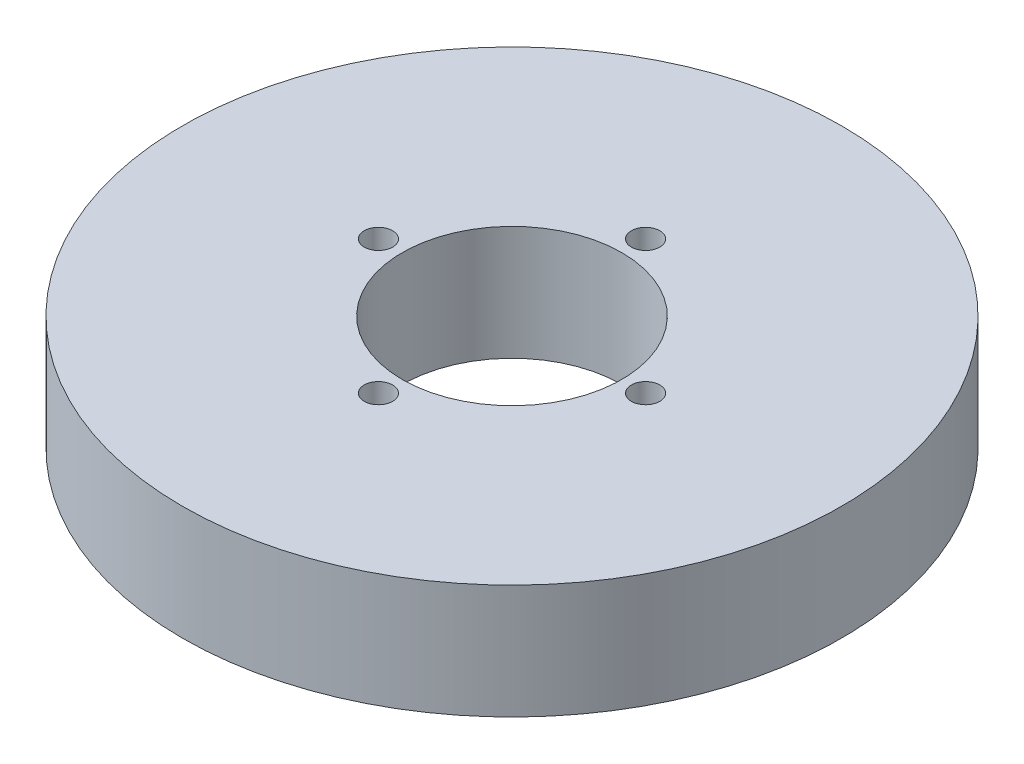
ISO-10303-21;
HEADER;
FILE_DESCRIPTION(('STEP AP214'),'2;1');
FILE_NAME('part.step','',(''),(''),'','','');
FILE_SCHEMA(('AUTOMOTIVE_DESIGN { 1 0 10303 214 1 1 1 1 }'));
ENDSEC;
DATA;
#1=APPLICATION_CONTEXT('core data for automotive mechanical design processes');
#2=APPLICATION_PROTOCOL_DEFINITION('international standard','automotive_design',2000,#1);
#3=PRODUCT_CONTEXT('',#1,'mechanical');
#4=PRODUCT('Part','Part','',(#3));
#5=PRODUCT_RELATED_PRODUCT_CATEGORY('part','',(#4));
#6=PRODUCT_DEFINITION_FORMATION('','',#4);
#7=PRODUCT_DEFINITION_CONTEXT('part definition',#1,'design');
#8=PRODUCT_DEFINITION('design','',#6,#7);
#9=PRODUCT_DEFINITION_SHAPE('','',#8);
#10=(LENGTH_UNIT() NAMED_UNIT(*) SI_UNIT(.MILLI.,.METRE.));
#11=(NAMED_UNIT(*) PLANE_ANGLE_UNIT() SI_UNIT($,.RADIAN.));
#12=(NAMED_UNIT(*) SI_UNIT($,.STERADIAN.) SOLID_ANGLE_UNIT());
#13=UNCERTAINTY_MEASURE_WITH_UNIT(LENGTH_MEASURE(1.E-05),#10,'distance_accuracy_value','');
#14=(GEOMETRIC_REPRESENTATION_CONTEXT(3) GLOBAL_UNCERTAINTY_ASSIGNED_CONTEXT((#13)) GLOBAL_UNIT_ASSIGNED_CONTEXT((#10,
#11,#12)) REPRESENTATION_CONTEXT('',''));
#15=CARTESIAN_POINT('',(0.,0.,0.));
#16=DIRECTION('',(0.,0.,1.));
#17=DIRECTION('',(1.,0.,0.));
#18=AXIS2_PLACEMENT_3D('',#15,#16,#17);
#19=CARTESIAN_POINT('',(0.,13.,0.));
#20=DIRECTION('',(0.,-1.,0.));
#21=DIRECTION('',(0.,0.,-1.));
#22=AXIS2_PLACEMENT_3D('',#19,#20,#21);
#23=CYLINDRICAL_SURFACE('',#22,37.5);
#24=CARTESIAN_POINT('',(0.,13.,0.));
#25=DIRECTION('',(0.,1.,0.));
#26=DIRECTION('',(0.,0.,1.));
#27=AXIS2_PLACEMENT_3D('',#24,#25,#26);
#28=CIRCLE('',#27,37.5);
#29=CARTESIAN_POINT('',(0.,13.,-37.5));
#30=VERTEX_POINT('',#29);
#31=EDGE_CURVE('E10',#30,#30,#28,.T.);
#32=CARTESIAN_POINT('',(0.,0.,0.));
#33=DIRECTION('',(0.,1.,0.));
#34=DIRECTION('',(0.,0.,1.));
#35=AXIS2_PLACEMENT_3D('',#32,#33,#34);
#36=CIRCLE('',#35,37.5);
#37=CARTESIAN_POINT('',(0.,0.,-37.5));
#38=VERTEX_POINT('',#37);
#39=EDGE_CURVE('E37',#38,#38,#36,.T.);
#40=CARTESIAN_POINT('',(0.,13.,-37.5));
#41=CARTESIAN_POINT('',(0.,12.8645833333333,-37.5));
#42=CARTESIAN_POINT('',(0.,12.7291666666667,-37.5));
#43=CARTESIAN_POINT('',(0.,12.4583333333333,-37.5));
#44=CARTESIAN_POINT('',(0.,12.3229166666667,-37.5));
#45=CARTESIAN_POINT('',(0.,12.0520833333333,-37.5));
#46=CARTESIAN_POINT('',(0.,11.9166666666667,-37.5));
#47=CARTESIAN_POINT('',(0.,11.6458333333333,-37.5));
#48=CARTESIAN_POINT('',(0.,11.5104166666667,-37.5));
#49=CARTESIAN_POINT('',(0.,11.2395833333333,-37.5));
#50=CARTESIAN_POINT('',(0.,11.1041666666667,-37.5));
#51=CARTESIAN_POINT('',(0.,10.8333333333333,-37.5));
#52=CARTESIAN_POINT('',(0.,10.6979166666667,-37.5));
#53=CARTESIAN_POINT('',(0.,10.4270833333333,-37.5));
#54=CARTESIAN_POINT('',(0.,10.2916666666667,-37.5));
#55=CARTESIAN_POINT('',(0.,10.0208333333333,-37.5));
#56=CARTESIAN_POINT('',(0.,9.88541666666667,-37.5));
#57=CARTESIAN_POINT('',(0.,9.61458333333333,-37.5));
#58=CARTESIAN_POINT('',(0.,9.47916666666667,-37.5));
#59=CARTESIAN_POINT('',(0.,9.20833333333333,-37.5));
#60=CARTESIAN_POINT('',(0.,9.07291666666666,-37.5));
#61=CARTESIAN_POINT('',(0.,8.80208333333333,-37.5));
#62=CARTESIAN_POINT('',(0.,8.66666666666667,-37.5));
#63=CARTESIAN_POINT('',(0.,8.39583333333333,-37.5));
#64=CARTESIAN_POINT('',(0.,8.26041666666667,-37.5));
#65=CARTESIAN_POINT('',(0.,7.98958333333333,-37.5));
#66=CARTESIAN_POINT('',(0.,7.85416666666667,-37.5));
#67=CARTESIAN_POINT('',(0.,7.58333333333333,-37.5));
#68=CARTESIAN_POINT('',(0.,7.44791666666667,-37.5));
#69=CARTESIAN_POINT('',(0.,7.17708333333333,-37.5));
#70=CARTESIAN_POINT('',(0.,7.04166666666667,-37.5));
#71=CARTESIAN_POINT('',(0.,6.77083333333333,-37.5));
#72=CARTESIAN_POINT('',(0.,6.63541666666667,-37.5));
#73=CARTESIAN_POINT('',(0.,6.36458333333333,-37.5));
#74=CARTESIAN_POINT('',(0.,6.22916666666667,-37.5));
#75=CARTESIAN_POINT('',(0.,5.95833333333333,-37.5));
#76=CARTESIAN_POINT('',(0.,5.82291666666667,-37.5));
#77=CARTESIAN_POINT('',(0.,5.55208333333333,-37.5));
#78=CARTESIAN_POINT('',(0.,5.41666666666667,-37.5));
#79=CARTESIAN_POINT('',(0.,5.14583333333333,-37.5));
#80=CARTESIAN_POINT('',(0.,5.01041666666667,-37.5));
#81=CARTESIAN_POINT('',(0.,4.73958333333333,-37.5));
#82=CARTESIAN_POINT('',(0.,4.60416666666667,-37.5));
#83=CARTESIAN_POINT('',(0.,4.33333333333333,-37.5));
#84=CARTESIAN_POINT('',(0.,4.19791666666667,-37.5));
#85=CARTESIAN_POINT('',(0.,3.92708333333333,-37.5));
#86=CARTESIAN_POINT('',(0.,3.79166666666667,-37.5));
#87=CARTESIAN_POINT('',(0.,3.52083333333333,-37.5));
#88=CARTESIAN_POINT('',(0.,3.38541666666667,-37.5));
#89=CARTESIAN_POINT('',(0.,3.11458333333333,-37.5));
#90=CARTESIAN_POINT('',(0.,2.97916666666667,-37.5));
#91=CARTESIAN_POINT('',(0.,2.70833333333333,-37.5));
#92=CARTESIAN_POINT('',(0.,2.57291666666667,-37.5));
#93=CARTESIAN_POINT('',(0.,2.30208333333333,-37.5));
#94=CARTESIAN_POINT('',(0.,2.16666666666667,-37.5));
#95=CARTESIAN_POINT('',(0.,1.89583333333333,-37.5));
#96=CARTESIAN_POINT('',(0.,1.76041666666667,-37.5));
#97=CARTESIAN_POINT('',(0.,1.48958333333333,-37.5));
#98=CARTESIAN_POINT('',(0.,1.35416666666667,-37.5));
#99=CARTESIAN_POINT('',(0.,1.08333333333333,-37.5));
#100=CARTESIAN_POINT('',(0.,0.947916666666667,-37.5));
#101=CARTESIAN_POINT('',(0.,0.677083333333334,-37.5));
#102=CARTESIAN_POINT('',(0.,0.541666666666667,-37.5));
#103=CARTESIAN_POINT('',(0.,0.270833333333334,-37.5));
#104=CARTESIAN_POINT('',(0.,0.135416666666667,-37.5));
#105=CARTESIAN_POINT('',(0.,0.,-37.5));
#106=B_SPLINE_CURVE_WITH_KNOTS('',3,(#40,#41,#42,#43,#44,#45,#46,#47,#48,#49,#50,#51,#52,#53,
#54,#55,#56,#57,#58,#59,#60,#61,#62,#63,#64,#65,#66,#67,#68,#69,#70,#71,#72,#73,#74,#75,#76,#77,
#78,#79,#80,#81,#82,#83,#84,#85,#86,#87,#88,#89,#90,#91,#92,#93,#94,#95,#96,#97,#98,#99,#100,
#101,#102,#103,#104,#105),.UNSPECIFIED.,.F.,.F.,(4,2,2,2,2,2,2,2,2,2,2,2,2,2,2,2,2,2,2,2,2,2,2,
2,2,2,2,2,2,2,2,2,4),(0.,0.40625,0.812500000000001,1.21875,1.625,2.03125,2.4375,2.84375,3.25,
3.65625,4.0625,4.46875,4.875,5.28125,5.6875,6.09375,6.5,6.90625,7.3125,7.71875,8.125,8.53125,
8.9375,9.34375,9.75,10.15625,10.5625,10.96875,11.375,11.78125,12.1875,12.59375,13.),.UNSPECIFIED.);
#107=EDGE_CURVE('BSEAM40',#30,#38,#106,.T.);
#108=ORIENTED_EDGE('',*,*,#31,.F.);
#109=ORIENTED_EDGE('',*,*,#39,.T.);
#110=ORIENTED_EDGE('',*,*,#107,.T.);
#111=ORIENTED_EDGE('',*,*,#107,.F.);
#112=EDGE_LOOP('',(#108,#110,#109,#111));
#113=FACE_BOUND('',#112,.T.);
#114=ADVANCED_FACE('F40',(#113),#23,.T.);
#115=CARTESIAN_POINT('',(0.,13.,0.));
#116=DIRECTION('',(0.,1.,0.));
#117=DIRECTION('',(0.,0.,1.));
#118=AXIS2_PLACEMENT_3D('',#115,#116,#117);
#119=PLANE('',#118);
#120=CARTESIAN_POINT('',(0.,13.,15.1993669089286));
#121=DIRECTION('',(0.,1.,0.));
#122=DIRECTION('',(1.,0.,0.));
#123=AXIS2_PLACEMENT_3D('',#120,#121,#122);
#124=CIRCLE('',#123,1.61808034722055);
#125=CARTESIAN_POINT('',(1.6180803472206,13.,15.1993669089285));
#126=VERTEX_POINT('',#125);
#127=EDGE_CURVE('E71',#126,#126,#124,.T.);
#128=ORIENTED_EDGE('',*,*,#127,.F.);
#129=EDGE_LOOP('',(#128));
#130=FACE_BOUND('',#129,.T.);
#131=CARTESIAN_POINT('',(15.1993669089286,13.,0.));
#132=DIRECTION('',(0.,1.,0.));
#133=DIRECTION('',(0.,0.,-1.));
#134=AXIS2_PLACEMENT_3D('',#131,#132,#133);
#135=CIRCLE('',#134,1.61808034722055);
#136=CARTESIAN_POINT('',(15.1993669089286,13.,-1.61808034722055));
#137=VERTEX_POINT('',#136);
#138=EDGE_CURVE('E70',#137,#137,#135,.T.);
#139=ORIENTED_EDGE('',*,*,#138,.F.);
#140=EDGE_LOOP('',(#139));
#141=FACE_BOUND('',#140,.T.);
#142=CARTESIAN_POINT('',(-1.59204917774262E-13,13.,-15.1993669089286));
#143=DIRECTION('',(0.,1.,0.));
#144=DIRECTION('',(-1.,0.,0.));
#145=AXIS2_PLACEMENT_3D('',#142,#143,#144);
#146=CIRCLE('',#145,1.61808034722055);
#147=CARTESIAN_POINT('',(-1.61808034722071,13.,-15.1993669089285));
#148=VERTEX_POINT('',#147);
#149=EDGE_CURVE('E61',#148,#148,#146,.T.);
#150=ORIENTED_EDGE('',*,*,#149,.F.);
#151=EDGE_LOOP('',(#150));
#152=FACE_BOUND('',#151,.T.);
#153=CARTESIAN_POINT('',(-15.1993669089286,13.,0.));
#154=DIRECTION('',(0.,1.,0.));
#155=DIRECTION('',(0.,0.,1.));
#156=AXIS2_PLACEMENT_3D('',#153,#154,#155);
#157=CIRCLE('',#156,1.61808034722055);
#158=CARTESIAN_POINT('',(-15.1993669089286,13.,1.61808034722055));
#159=VERTEX_POINT('',#158);
#160=EDGE_CURVE('E54',#159,#159,#157,.T.);
#161=ORIENTED_EDGE('',*,*,#160,.F.);
#162=EDGE_LOOP('',(#161));
#163=FACE_BOUND('',#162,.T.);
#164=CARTESIAN_POINT('',(0.,13.,0.));
#165=DIRECTION('',(0.,1.,0.));
#166=DIRECTION('',(0.,0.,1.));
#167=AXIS2_PLACEMENT_3D('',#164,#165,#166);
#168=CIRCLE('',#167,12.5);
#169=CARTESIAN_POINT('',(0.,13.,-12.5));
#170=VERTEX_POINT('',#169);
#171=EDGE_CURVE('E50',#170,#170,#168,.T.);
#172=ORIENTED_EDGE('',*,*,#171,.F.);
#173=EDGE_LOOP('',(#172));
#174=FACE_BOUND('',#173,.T.);
#175=ORIENTED_EDGE('',*,*,#31,.T.);
#176=EDGE_LOOP('',(#175));
#177=FACE_BOUND('',#176,.T.);
#178=ADVANCED_FACE('F86',(#130,#141,#152,#163,#174,#177),#119,.T.);
#179=CARTESIAN_POINT('',(0.,0.,0.));
#180=DIRECTION('',(0.,1.,0.));
#181=DIRECTION('',(0.,0.,1.));
#182=AXIS2_PLACEMENT_3D('',#179,#180,#181);
#183=PLANE('',#182);
#184=CARTESIAN_POINT('',(0.,0.,0.));
#185=DIRECTION('',(0.,1.,0.));
#186=DIRECTION('',(0.,0.,1.));
#187=AXIS2_PLACEMENT_3D('',#184,#185,#186);
#188=CIRCLE('',#187,12.5);
#189=CARTESIAN_POINT('',(0.,0.,-12.5));
#190=VERTEX_POINT('',#189);
#191=EDGE_CURVE('E47',#190,#190,#188,.T.);
#192=ORIENTED_EDGE('',*,*,#191,.T.);
#193=EDGE_LOOP('',(#192));
#194=FACE_BOUND('',#193,.T.);
#195=ORIENTED_EDGE('',*,*,#39,.F.);
#196=EDGE_LOOP('',(#195));
#197=FACE_BOUND('',#196,.T.);
#198=ADVANCED_FACE('F93',(#194,#197),#183,.F.);
#199=CARTESIAN_POINT('',(0.,13.,0.));
#200=DIRECTION('',(0.,-1.,0.));
#201=DIRECTION('',(0.,0.,-1.));
#202=AXIS2_PLACEMENT_3D('',#199,#200,#201);
#203=CYLINDRICAL_SURFACE('',#202,12.5);
#204=CARTESIAN_POINT('',(0.,13.,-12.5));
#205=CARTESIAN_POINT('',(0.,12.8645833333333,-12.5));
#206=CARTESIAN_POINT('',(0.,12.7291666666667,-12.5));
#207=CARTESIAN_POINT('',(0.,12.4583333333333,-12.5));
#208=CARTESIAN_POINT('',(0.,12.3229166666667,-12.5));
#209=CARTESIAN_POINT('',(0.,12.0520833333333,-12.5));
#210=CARTESIAN_POINT('',(0.,11.9166666666667,-12.5));
#211=CARTESIAN_POINT('',(0.,11.6458333333333,-12.5));
#212=CARTESIAN_POINT('',(0.,11.5104166666667,-12.5));
#213=CARTESIAN_POINT('',(0.,11.2395833333333,-12.5));
#214=CARTESIAN_POINT('',(0.,11.1041666666667,-12.5));
#215=CARTESIAN_POINT('',(0.,10.8333333333333,-12.5));
#216=CARTESIAN_POINT('',(0.,10.6979166666667,-12.5));
#217=CARTESIAN_POINT('',(0.,10.4270833333333,-12.5));
#218=CARTESIAN_POINT('',(0.,10.2916666666667,-12.5));
#219=CARTESIAN_POINT('',(0.,10.0208333333333,-12.5));
#220=CARTESIAN_POINT('',(0.,9.88541666666667,-12.5));
#221=CARTESIAN_POINT('',(0.,9.61458333333333,-12.5));
#222=CARTESIAN_POINT('',(0.,9.47916666666667,-12.5));
#223=CARTESIAN_POINT('',(0.,9.20833333333333,-12.5));
#224=CARTESIAN_POINT('',(0.,9.07291666666666,-12.5));
#225=CARTESIAN_POINT('',(0.,8.80208333333333,-12.5));
#226=CARTESIAN_POINT('',(0.,8.66666666666667,-12.5));
#227=CARTESIAN_POINT('',(0.,8.39583333333333,-12.5));
#228=CARTESIAN_POINT('',(0.,8.26041666666667,-12.5));
#229=CARTESIAN_POINT('',(0.,7.98958333333333,-12.5));
#230=CARTESIAN_POINT('',(0.,7.85416666666667,-12.5));
#231=CARTESIAN_POINT('',(0.,7.58333333333333,-12.5));
#232=CARTESIAN_POINT('',(0.,7.44791666666667,-12.5));
#233=CARTESIAN_POINT('',(0.,7.17708333333333,-12.5));
#234=CARTESIAN_POINT('',(0.,7.04166666666667,-12.5));
#235=CARTESIAN_POINT('',(0.,6.77083333333333,-12.5));
#236=CARTESIAN_POINT('',(0.,6.63541666666667,-12.5));
#237=CARTESIAN_POINT('',(0.,6.36458333333333,-12.5));
#238=CARTESIAN_POINT('',(0.,6.22916666666667,-12.5));
#239=CARTESIAN_POINT('',(0.,5.95833333333333,-12.5));
#240=CARTESIAN_POINT('',(0.,5.82291666666667,-12.5));
#241=CARTESIAN_POINT('',(0.,5.55208333333333,-12.5));
#242=CARTESIAN_POINT('',(0.,5.41666666666667,-12.5));
#243=CARTESIAN_POINT('',(0.,5.14583333333333,-12.5));
#244=CARTESIAN_POINT('',(0.,5.01041666666667,-12.5));
#245=CARTESIAN_POINT('',(0.,4.73958333333333,-12.5));
#246=CARTESIAN_POINT('',(0.,4.60416666666667,-12.5));
#247=CARTESIAN_POINT('',(0.,4.33333333333333,-12.5));
#248=CARTESIAN_POINT('',(0.,4.19791666666667,-12.5));
#249=CARTESIAN_POINT('',(0.,3.92708333333333,-12.5));
#250=CARTESIAN_POINT('',(0.,3.79166666666667,-12.5));
#251=CARTESIAN_POINT('',(0.,3.52083333333333,-12.5));
#252=CARTESIAN_POINT('',(0.,3.38541666666667,-12.5));
#253=CARTESIAN_POINT('',(0.,3.11458333333333,-12.5));
#254=CARTESIAN_POINT('',(0.,2.97916666666667,-12.5));
#255=CARTESIAN_POINT('',(0.,2.70833333333333,-12.5));
#256=CARTESIAN_POINT('',(0.,2.57291666666667,-12.5));
#257=CARTESIAN_POINT('',(0.,2.30208333333333,-12.5));
#258=CARTESIAN_POINT('',(0.,2.16666666666667,-12.5));
#259=CARTESIAN_POINT('',(0.,1.89583333333333,-12.5));
#260=CARTESIAN_POINT('',(0.,1.76041666666667,-12.5));
#261=CARTESIAN_POINT('',(0.,1.48958333333333,-12.5));
#262=CARTESIAN_POINT('',(0.,1.35416666666667,-12.5));
#263=CARTESIAN_POINT('',(0.,1.08333333333333,-12.5));
#264=CARTESIAN_POINT('',(0.,0.947916666666667,-12.5));
#265=CARTESIAN_POINT('',(0.,0.677083333333334,-12.5));
#266=CARTESIAN_POINT('',(0.,0.541666666666667,-12.5));
#267=CARTESIAN_POINT('',(0.,0.270833333333334,-12.5));
#268=CARTESIAN_POINT('',(0.,0.135416666666667,-12.5));
#269=CARTESIAN_POINT('',(0.,0.,-12.5));
#270=B_SPLINE_CURVE_WITH_KNOTS('',3,(#204,#205,#206,#207,#208,#209,#210,#211,#212,#213,#214,
#215,#216,#217,#218,#219,#220,#221,#222,#223,#224,#225,#226,#227,#228,#229,#230,#231,#232,#233,
#234,#235,#236,#237,#238,#239,#240,#241,#242,#243,#244,#245,#246,#247,#248,#249,#250,#251,#252,
#253,#254,#255,#256,#257,#258,#259,#260,#261,#262,#263,#264,#265,#266,#267,#268,#269),
.UNSPECIFIED.,.F.,.F.,(4,2,2,2,2,2,2,2,2,2,2,2,2,2,2,2,2,2,2,2,2,2,2,2,2,2,2,2,2,2,2,2,4),(0.,
0.40625,0.812500000000001,1.21875,1.625,2.03125,2.4375,2.84375,3.25,3.65625,4.0625,4.46875,
4.875,5.28125,5.6875,6.09375,6.5,6.90625,7.3125,7.71875,8.125,8.53125,8.9375,9.34375,9.75,
10.15625,10.5625,10.96875,11.375,11.78125,12.1875,12.59375,13.),.UNSPECIFIED.);
#271=EDGE_CURVE('BSEAM101',#170,#190,#270,.T.);
#272=ORIENTED_EDGE('',*,*,#171,.T.);
#273=ORIENTED_EDGE('',*,*,#191,.F.);
#274=ORIENTED_EDGE('',*,*,#271,.T.);
#275=ORIENTED_EDGE('',*,*,#271,.F.);
#276=EDGE_LOOP('',(#272,#274,#273,#275));
#277=FACE_BOUND('',#276,.T.);
#278=ADVANCED_FACE('F101',(#277),#203,.F.);
#279=CARTESIAN_POINT('',(-15.1993669089286,0.421937465853841,0.));
#280=DIRECTION('',(0.,1.,0.));
#281=DIRECTION('',(0.,0.,1.));
#282=AXIS2_PLACEMENT_3D('',#279,#280,#281);
#283=CYLINDRICAL_SURFACE('',#282,1.61808034722055);
#284=CARTESIAN_POINT('',(-15.1993669089286,0.421937465853841,0.));
#285=DIRECTION('',(0.,1.,0.));
#286=DIRECTION('',(0.,0.,1.));
#287=AXIS2_PLACEMENT_3D('',#284,#285,#286);
#288=CIRCLE('',#287,1.61808034722055);
#289=CARTESIAN_POINT('',(-15.1993669089286,0.421937465853841,1.61808034722055));
#290=VERTEX_POINT('',#289);
#291=EDGE_CURVE('E55',#290,#290,#288,.T.);
#292=ORIENTED_EDGE('',*,*,#291,.F.);
#293=EDGE_LOOP('',(#292));
#294=FACE_BOUND('',#293,.T.);
#295=ORIENTED_EDGE('',*,*,#160,.T.);
#296=EDGE_LOOP('',(#295));
#297=FACE_BOUND('',#296,.T.);
#298=ADVANCED_FACE('F102',(#294,#297),#283,.F.);
#299=CARTESIAN_POINT('',(-15.1993669089286,0.421937465853841,0.));
#300=DIRECTION('',(0.,1.,0.));
#301=DIRECTION('',(0.,0.,1.));
#302=AXIS2_PLACEMENT_3D('',#299,#300,#301);
#303=PLANE('',#302);
#304=ORIENTED_EDGE('',*,*,#291,.T.);
#305=EDGE_LOOP('',(#304));
#306=FACE_BOUND('',#305,.T.);
#307=ADVANCED_FACE('F133',(#306),#303,.T.);
#308=CARTESIAN_POINT('',(-1.59204917774262E-13,0.421937465853841,-15.1993669089286));
#309=DIRECTION('',(0.,1.,0.));
#310=DIRECTION('',(0.,0.,1.));
#311=AXIS2_PLACEMENT_3D('',#308,#309,#310);
#312=CYLINDRICAL_SURFACE('',#311,1.61808034722055);
#313=CARTESIAN_POINT('',(-1.59204917774262E-13,0.421937465853841,-15.1993669089286));
#314=DIRECTION('',(0.,1.,0.));
#315=DIRECTION('',(-1.,0.,0.));
#316=AXIS2_PLACEMENT_3D('',#313,#314,#315);
#317=CIRCLE('',#316,1.61808034722055);
#318=CARTESIAN_POINT('',(-1.61808034722071,0.421937465853841,-15.1993669089285));
#319=VERTEX_POINT('',#318);
#320=EDGE_CURVE('E63',#319,#319,#317,.T.);
#321=ORIENTED_EDGE('',*,*,#320,.F.);
#322=EDGE_LOOP('',(#321));
#323=FACE_BOUND('',#322,.T.);
#324=ORIENTED_EDGE('',*,*,#149,.T.);
#325=EDGE_LOOP('',(#324));
#326=FACE_BOUND('',#325,.T.);
#327=ADVANCED_FACE('F142',(#323,#326),#312,.F.);
#328=CARTESIAN_POINT('',(-1.59204917774262E-13,0.421937465853841,-15.1993669089286));
#329=DIRECTION('',(0.,1.,0.));
#330=DIRECTION('',(-1.,0.,0.));
#331=AXIS2_PLACEMENT_3D('',#328,#329,#330);
#332=PLANE('',#331);
#333=ORIENTED_EDGE('',*,*,#320,.T.);
#334=EDGE_LOOP('',(#333));
#335=FACE_BOUND('',#334,.T.);
#336=ADVANCED_FACE('F156',(#335),#332,.T.);
#337=CARTESIAN_POINT('',(15.1993669089286,0.421937465853841,0.));
#338=DIRECTION('',(0.,1.,0.));
#339=DIRECTION('',(0.,0.,1.));
#340=AXIS2_PLACEMENT_3D('',#337,#338,#339);
#341=CYLINDRICAL_SURFACE('',#340,1.61808034722055);
#342=CARTESIAN_POINT('',(15.1993669089286,0.421937465853841,0.));
#343=DIRECTION('',(0.,1.,0.));
#344=DIRECTION('',(0.,0.,-1.));
#345=AXIS2_PLACEMENT_3D('',#342,#343,#344);
#346=CIRCLE('',#345,1.61808034722055);
#347=CARTESIAN_POINT('',(15.1993669089286,0.421937465853841,-1.61808034722055));
#348=VERTEX_POINT('',#347);
#349=EDGE_CURVE('E69',#348,#348,#346,.T.);
#350=ORIENTED_EDGE('',*,*,#349,.F.);
#351=EDGE_LOOP('',(#350));
#352=FACE_BOUND('',#351,.T.);
#353=ORIENTED_EDGE('',*,*,#138,.T.);
#354=EDGE_LOOP('',(#353));
#355=FACE_BOUND('',#354,.T.);
#356=ADVANCED_FACE('F164',(#352,#355),#341,.F.);
#357=CARTESIAN_POINT('',(15.1993669089286,0.421937465853841,0.));
#358=DIRECTION('',(0.,1.,0.));
#359=DIRECTION('',(0.,0.,-1.));
#360=AXIS2_PLACEMENT_3D('',#357,#358,#359);
#361=PLANE('',#360);
#362=ORIENTED_EDGE('',*,*,#349,.T.);
#363=EDGE_LOOP('',(#362));
#364=FACE_BOUND('',#363,.T.);
#365=ADVANCED_FACE('F83',(#364),#361,.T.);
#366=CARTESIAN_POINT('',(0.,0.421937465853841,15.1993669089286));
#367=DIRECTION('',(0.,1.,0.));
#368=DIRECTION('',(0.,0.,1.));
#369=AXIS2_PLACEMENT_3D('',#366,#367,#368);
#370=CYLINDRICAL_SURFACE('',#369,1.61808034722055);
#371=CARTESIAN_POINT('',(0.,0.421937465853841,15.1993669089286));
#372=DIRECTION('',(0.,1.,0.));
#373=DIRECTION('',(1.,0.,0.));
#374=AXIS2_PLACEMENT_3D('',#371,#372,#373);
#375=CIRCLE('',#374,1.61808034722055);
#376=CARTESIAN_POINT('',(1.6180803472206,0.421937465853841,15.1993669089285));
#377=VERTEX_POINT('',#376);
#378=EDGE_CURVE('E59',#377,#377,#375,.T.);
#379=ORIENTED_EDGE('',*,*,#378,.F.);
#380=EDGE_LOOP('',(#379));
#381=FACE_BOUND('',#380,.T.);
#382=ORIENTED_EDGE('',*,*,#127,.T.);
#383=EDGE_LOOP('',(#382));
#384=FACE_BOUND('',#383,.T.);
#385=ADVANCED_FACE('F81',(#381,#384),#370,.F.);
#386=CARTESIAN_POINT('',(0.,0.421937465853841,15.1993669089286));
#387=DIRECTION('',(0.,1.,0.));
#388=DIRECTION('',(1.,0.,0.));
#389=AXIS2_PLACEMENT_3D('',#386,#387,#388);
#390=PLANE('',#389);
#391=ORIENTED_EDGE('',*,*,#378,.T.);
#392=EDGE_LOOP('',(#391));
#393=FACE_BOUND('',#392,.T.);
#394=ADVANCED_FACE('F78',(#393),#390,.T.);
#395=CLOSED_SHELL('',(#114,#178,#198,#278,#298,#307,#327,#336,#356,#365,#385,#394));
#396=MANIFOLD_SOLID_BREP('B2',#395);
#397=ADVANCED_BREP_SHAPE_REPRESENTATION('',(#18,#396),#14);
#398=SHAPE_DEFINITION_REPRESENTATION(#9,#397);
ENDSEC;
END-ISO-10303-21;
